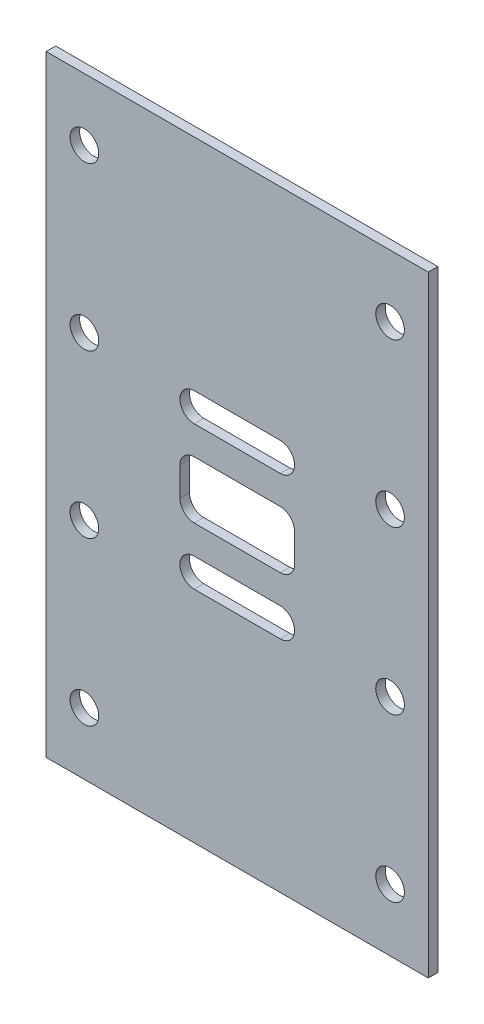
ISO-10303-21;
HEADER;
FILE_DESCRIPTION(('STEP AP214'),'2;1');
FILE_NAME('part.step','',(''),(''),'','','');
FILE_SCHEMA(('AUTOMOTIVE_DESIGN { 1 0 10303 214 1 1 1 1 }'));
ENDSEC;
DATA;
#1=APPLICATION_CONTEXT('core data for automotive mechanical design processes');
#2=APPLICATION_PROTOCOL_DEFINITION('international standard','automotive_design',2000,#1);
#3=PRODUCT_CONTEXT('',#1,'mechanical');
#4=PRODUCT('Part','Part','',(#3));
#5=PRODUCT_RELATED_PRODUCT_CATEGORY('part','',(#4));
#6=PRODUCT_DEFINITION_FORMATION('','',#4);
#7=PRODUCT_DEFINITION_CONTEXT('part definition',#1,'design');
#8=PRODUCT_DEFINITION('design','',#6,#7);
#9=PRODUCT_DEFINITION_SHAPE('','',#8);
#10=(LENGTH_UNIT() NAMED_UNIT(*) SI_UNIT(.MILLI.,.METRE.));
#11=(NAMED_UNIT(*) PLANE_ANGLE_UNIT() SI_UNIT($,.RADIAN.));
#12=(NAMED_UNIT(*) SI_UNIT($,.STERADIAN.) SOLID_ANGLE_UNIT());
#13=UNCERTAINTY_MEASURE_WITH_UNIT(LENGTH_MEASURE(1.E-05),#10,'distance_accuracy_value','');
#14=(GEOMETRIC_REPRESENTATION_CONTEXT(3) GLOBAL_UNCERTAINTY_ASSIGNED_CONTEXT((#13)) GLOBAL_UNIT_ASSIGNED_CONTEXT((#10,
#11,#12)) REPRESENTATION_CONTEXT('',''));
#15=CARTESIAN_POINT('',(0.,0.,0.));
#16=DIRECTION('',(0.,0.,1.));
#17=DIRECTION('',(1.,0.,0.));
#18=AXIS2_PLACEMENT_3D('',#15,#16,#17);
#19=CARTESIAN_POINT('',(0.,0.,1.));
#20=DIRECTION('',(0.,0.,-1.));
#21=DIRECTION('',(-1.,0.,0.));
#22=AXIS2_PLACEMENT_3D('',#19,#20,#21);
#23=PLANE('',#22);
#24=CARTESIAN_POINT('',(16.2605633802817,-9.76760563380282,1.));
#25=DIRECTION('',(0.,0.,1.));
#26=DIRECTION('',(1.,0.,0.));
#27=AXIS2_PLACEMENT_3D('',#24,#25,#26);
#28=CIRCLE('',#27,1.5);
#29=CARTESIAN_POINT('',(17.7605633802817,-9.76760563380282,1.));
#30=VERTEX_POINT('',#29);
#31=CARTESIAN_POINT('',(16.2605633802817,-11.2676056338028,1.));
#32=VERTEX_POINT('',#31);
#33=EDGE_CURVE('E404',#30,#32,#28,.F.);
#34=ORIENTED_EDGE('',*,*,#33,.T.);
#35=DIRECTION('',(-1.,0.,0.));
#36=VECTOR('',#35,1.);
#37=CARTESIAN_POINT('',(0.,-11.2676056338028,1.));
#38=LINE('',#37,#36);
#39=CARTESIAN_POINT('',(7.26056338028169,-11.2676056338028,1.));
#40=VERTEX_POINT('',#39);
#41=EDGE_CURVE('E400',#32,#40,#38,.T.);
#42=ORIENTED_EDGE('',*,*,#41,.T.);
#43=CARTESIAN_POINT('',(7.26056338028169,-9.76760563380282,1.));
#44=DIRECTION('',(0.,0.,1.));
#45=DIRECTION('',(1.,0.,0.));
#46=AXIS2_PLACEMENT_3D('',#43,#44,#45);
#47=CIRCLE('',#46,1.5);
#48=CARTESIAN_POINT('',(5.76056338028169,-9.76760563380282,1.));
#49=VERTEX_POINT('',#48);
#50=EDGE_CURVE('E395',#40,#49,#47,.F.);
#51=ORIENTED_EDGE('',*,*,#50,.T.);
#52=DIRECTION('',(0.,1.,0.));
#53=VECTOR('',#52,1.);
#54=CARTESIAN_POINT('',(5.76056338028169,0.,1.));
#55=LINE('',#54,#53);
#56=CARTESIAN_POINT('',(5.76056338028169,-6.76760563380282,1.));
#57=VERTEX_POINT('',#56);
#58=EDGE_CURVE('E420',#57,#49,#55,.F.);
#59=ORIENTED_EDGE('',*,*,#58,.F.);
#60=CARTESIAN_POINT('',(7.26056338028169,-6.76760563380282,1.));
#61=DIRECTION('',(0.,0.,1.));
#62=DIRECTION('',(1.,0.,0.));
#63=AXIS2_PLACEMENT_3D('',#60,#61,#62);
#64=CIRCLE('',#63,1.5);
#65=CARTESIAN_POINT('',(7.26056338028169,-5.26760563380282,1.));
#66=VERTEX_POINT('',#65);
#67=EDGE_CURVE('E416',#57,#66,#64,.F.);
#68=ORIENTED_EDGE('',*,*,#67,.T.);
#69=DIRECTION('',(-1.,0.,0.));
#70=VECTOR('',#69,1.);
#71=CARTESIAN_POINT('',(0.,-5.26760563380282,1.));
#72=LINE('',#71,#70);
#73=CARTESIAN_POINT('',(16.2605633802817,-5.26760563380282,1.));
#74=VERTEX_POINT('',#73);
#75=EDGE_CURVE('E412',#66,#74,#72,.F.);
#76=ORIENTED_EDGE('',*,*,#75,.T.);
#77=CARTESIAN_POINT('',(16.2605633802817,-6.76760563380282,1.));
#78=DIRECTION('',(0.,0.,1.));
#79=DIRECTION('',(1.,0.,0.));
#80=AXIS2_PLACEMENT_3D('',#77,#78,#79);
#81=CIRCLE('',#80,1.5);
#82=CARTESIAN_POINT('',(17.7605633802817,-6.76760563380283,1.));
#83=VERTEX_POINT('',#82);
#84=EDGE_CURVE('E391',#74,#83,#81,.F.);
#85=ORIENTED_EDGE('',*,*,#84,.T.);
#86=DIRECTION('',(0.,-1.,0.));
#87=VECTOR('',#86,1.);
#88=CARTESIAN_POINT('',(17.7605633802817,0.,1.));
#89=LINE('',#88,#87);
#90=EDGE_CURVE('E408',#30,#83,#89,.F.);
#91=ORIENTED_EDGE('',*,*,#90,.F.);
#92=EDGE_LOOP('',(#34,#42,#51,#59,#68,#76,#85,#91));
#93=FACE_BOUND('',#92,.T.);
#94=CARTESIAN_POINT('',(27.7605633802817,-33.7676056338028,1.));
#95=DIRECTION('',(0.,0.,-1.));
#96=DIRECTION('',(-1.,0.,0.));
#97=AXIS2_PLACEMENT_3D('',#94,#95,#96);
#98=CIRCLE('',#97,1.5);
#99=CARTESIAN_POINT('',(26.2605633802817,-33.7676056338028,1.));
#100=VERTEX_POINT('',#99);
#101=EDGE_CURVE('E285',#100,#100,#98,.T.);
#102=ORIENTED_EDGE('',*,*,#101,.T.);
#103=EDGE_LOOP('',(#102));
#104=FACE_BOUND('',#103,.T.);
#105=CARTESIAN_POINT('',(-4.23943661971831,-16.7676056338028,1.));
#106=DIRECTION('',(0.,0.,-1.));
#107=DIRECTION('',(-1.,0.,0.));
#108=AXIS2_PLACEMENT_3D('',#105,#106,#107);
#109=CIRCLE('',#108,1.5);
#110=CARTESIAN_POINT('',(-5.73943661971831,-16.7676056338028,1.));
#111=VERTEX_POINT('',#110);
#112=EDGE_CURVE('E348',#111,#111,#109,.T.);
#113=ORIENTED_EDGE('',*,*,#112,.T.);
#114=EDGE_LOOP('',(#113));
#115=FACE_BOUND('',#114,.T.);
#116=CARTESIAN_POINT('',(-4.23943661971831,-33.7676056338028,1.));
#117=DIRECTION('',(0.,0.,-1.));
#118=DIRECTION('',(-1.,0.,0.));
#119=AXIS2_PLACEMENT_3D('',#116,#117,#118);
#120=CIRCLE('',#119,1.5);
#121=CARTESIAN_POINT('',(-5.73943661971831,-33.7676056338028,1.));
#122=VERTEX_POINT('',#121);
#123=EDGE_CURVE('E344',#122,#122,#120,.T.);
#124=ORIENTED_EDGE('',*,*,#123,.T.);
#125=EDGE_LOOP('',(#124));
#126=FACE_BOUND('',#125,.T.);
#127=CARTESIAN_POINT('',(27.7605633802817,-16.7676056338028,1.));
#128=DIRECTION('',(0.,0.,-1.));
#129=DIRECTION('',(-1.,0.,0.));
#130=AXIS2_PLACEMENT_3D('',#127,#128,#129);
#131=CIRCLE('',#130,1.5);
#132=CARTESIAN_POINT('',(26.2605633802817,-16.7676056338028,1.));
#133=VERTEX_POINT('',#132);
#134=EDGE_CURVE('E340',#133,#133,#131,.T.);
#135=ORIENTED_EDGE('',*,*,#134,.T.);
#136=EDGE_LOOP('',(#135));
#137=FACE_BOUND('',#136,.T.);
#138=CARTESIAN_POINT('',(27.7605633802817,0.232394366197181,1.));
#139=DIRECTION('',(0.,0.,-1.));
#140=DIRECTION('',(-1.,0.,0.));
#141=AXIS2_PLACEMENT_3D('',#138,#139,#140);
#142=CIRCLE('',#141,1.5);
#143=CARTESIAN_POINT('',(26.2605633802817,0.232394366197181,1.));
#144=VERTEX_POINT('',#143);
#145=EDGE_CURVE('E336',#144,#144,#142,.T.);
#146=ORIENTED_EDGE('',*,*,#145,.T.);
#147=EDGE_LOOP('',(#146));
#148=FACE_BOUND('',#147,.T.);
#149=CARTESIAN_POINT('',(-4.23943661971831,0.232394366197181,1.));
#150=DIRECTION('',(0.,0.,-1.));
#151=DIRECTION('',(-1.,0.,0.));
#152=AXIS2_PLACEMENT_3D('',#149,#150,#151);
#153=CIRCLE('',#152,1.5);
#154=CARTESIAN_POINT('',(-5.73943661971831,0.232394366197181,1.));
#155=VERTEX_POINT('',#154);
#156=EDGE_CURVE('E332',#155,#155,#153,.T.);
#157=ORIENTED_EDGE('',*,*,#156,.T.);
#158=EDGE_LOOP('',(#157));
#159=FACE_BOUND('',#158,.T.);
#160=CARTESIAN_POINT('',(27.7605633802817,17.2323943661972,1.));
#161=DIRECTION('',(0.,0.,-1.));
#162=DIRECTION('',(-1.,0.,0.));
#163=AXIS2_PLACEMENT_3D('',#160,#161,#162);
#164=CIRCLE('',#163,1.5);
#165=CARTESIAN_POINT('',(26.2605633802817,17.2323943661972,1.));
#166=VERTEX_POINT('',#165);
#167=EDGE_CURVE('E328',#166,#166,#164,.T.);
#168=ORIENTED_EDGE('',*,*,#167,.T.);
#169=EDGE_LOOP('',(#168));
#170=FACE_BOUND('',#169,.T.);
#171=CARTESIAN_POINT('',(-4.23943661971831,17.2323943661972,1.));
#172=DIRECTION('',(0.,0.,-1.));
#173=DIRECTION('',(-1.,0.,0.));
#174=AXIS2_PLACEMENT_3D('',#171,#172,#173);
#175=CIRCLE('',#174,1.5);
#176=CARTESIAN_POINT('',(-5.73943661971831,17.2323943661972,1.));
#177=VERTEX_POINT('',#176);
#178=EDGE_CURVE('E324',#177,#177,#175,.T.);
#179=ORIENTED_EDGE('',*,*,#178,.T.);
#180=EDGE_LOOP('',(#179));
#181=FACE_BOUND('',#180,.T.);
#182=DIRECTION('',(0.,-1.,0.));
#183=VECTOR('',#182,1.);
#184=CARTESIAN_POINT('',(-8.23943661971831,-40.2676056338028,1.));
#185=LINE('',#184,#183);
#186=CARTESIAN_POINT('',(-8.23943661971831,23.7323943661972,1.));
#187=VERTEX_POINT('',#186);
#188=CARTESIAN_POINT('',(-8.23943661971831,-40.2676056338028,1.));
#189=VERTEX_POINT('',#188);
#190=EDGE_CURVE('E353',#187,#189,#185,.T.);
#191=ORIENTED_EDGE('',*,*,#190,.T.);
#192=DIRECTION('',(1.,0.,0.));
#193=VECTOR('',#192,1.);
#194=CARTESIAN_POINT('',(-8.23943661971831,-40.2676056338028,1.));
#195=LINE('',#194,#193);
#196=CARTESIAN_POINT('',(31.7605633802817,-40.2676056338028,1.));
#197=VERTEX_POINT('',#196);
#198=EDGE_CURVE('E357',#189,#197,#195,.T.);
#199=ORIENTED_EDGE('',*,*,#198,.T.);
#200=DIRECTION('',(0.,1.,0.));
#201=VECTOR('',#200,1.);
#202=CARTESIAN_POINT('',(31.7605633802817,-40.2676056338028,1.));
#203=LINE('',#202,#201);
#204=CARTESIAN_POINT('',(31.7605633802817,23.7323943661972,1.));
#205=VERTEX_POINT('',#204);
#206=EDGE_CURVE('E362',#197,#205,#203,.T.);
#207=ORIENTED_EDGE('',*,*,#206,.T.);
#208=DIRECTION('',(-1.,0.,0.));
#209=VECTOR('',#208,1.);
#210=CARTESIAN_POINT('',(-8.23943661971831,23.7323943661972,1.));
#211=LINE('',#210,#209);
#212=EDGE_CURVE('E366',#205,#187,#211,.T.);
#213=ORIENTED_EDGE('',*,*,#212,.T.);
#214=EDGE_LOOP('',(#191,#199,#207,#213));
#215=FACE_BOUND('',#214,.T.);
#216=CARTESIAN_POINT('',(16.2605633802817,-0.767605633802819,1.));
#217=DIRECTION('',(0.,0.,1.));
#218=DIRECTION('',(1.,0.,0.));
#219=AXIS2_PLACEMENT_3D('',#216,#217,#218);
#220=CIRCLE('',#219,1.50000000000002);
#221=CARTESIAN_POINT('',(16.2605633802817,-2.26760563380282,1.));
#222=VERTEX_POINT('',#221);
#223=CARTESIAN_POINT('',(16.2605633802817,0.732394366197185,1.));
#224=VERTEX_POINT('',#223);
#225=EDGE_CURVE('E266',#222,#224,#220,.T.);
#226=ORIENTED_EDGE('',*,*,#225,.F.);
#227=DIRECTION('',(1.,0.,0.));
#228=VECTOR('',#227,1.);
#229=CARTESIAN_POINT('',(0.,-2.26760563380282,1.));
#230=LINE('',#229,#228);
#231=CARTESIAN_POINT('',(7.26056338028169,-2.26760563380282,1.));
#232=VERTEX_POINT('',#231);
#233=EDGE_CURVE('E254',#232,#222,#230,.T.);
#234=ORIENTED_EDGE('',*,*,#233,.F.);
#235=CARTESIAN_POINT('',(7.26056338028169,-0.76760563380282,1.));
#236=DIRECTION('',(0.,0.,1.));
#237=DIRECTION('',(1.,0.,0.));
#238=AXIS2_PLACEMENT_3D('',#235,#236,#237);
#239=CIRCLE('',#238,1.5);
#240=CARTESIAN_POINT('',(7.26056338028169,0.732394366197181,1.));
#241=VERTEX_POINT('',#240);
#242=EDGE_CURVE('E244',#241,#232,#239,.T.);
#243=ORIENTED_EDGE('',*,*,#242,.F.);
#244=DIRECTION('',(-1.,0.,0.));
#245=VECTOR('',#244,1.);
#246=CARTESIAN_POINT('',(0.,0.732394366197181,1.));
#247=LINE('',#246,#245);
#248=EDGE_CURVE('E238',#241,#224,#247,.F.);
#249=ORIENTED_EDGE('',*,*,#248,.T.);
#250=EDGE_LOOP('',(#226,#234,#243,#249));
#251=FACE_BOUND('',#250,.T.);
#252=CARTESIAN_POINT('',(16.2605633802817,-15.7676056338028,1.));
#253=DIRECTION('',(0.,0.,1.));
#254=DIRECTION('',(1.,0.,0.));
#255=AXIS2_PLACEMENT_3D('',#252,#253,#254);
#256=CIRCLE('',#255,1.5);
#257=CARTESIAN_POINT('',(16.2605633802817,-17.2676056338028,1.));
#258=VERTEX_POINT('',#257);
#259=CARTESIAN_POINT('',(16.2605633802817,-14.2676056338028,1.));
#260=VERTEX_POINT('',#259);
#261=EDGE_CURVE('E268',#258,#260,#256,.T.);
#262=ORIENTED_EDGE('',*,*,#261,.F.);
#263=DIRECTION('',(1.,0.,0.));
#264=VECTOR('',#263,1.);
#265=CARTESIAN_POINT('',(0.,-17.2676056338028,1.));
#266=LINE('',#265,#264);
#267=CARTESIAN_POINT('',(7.2605633802817,-17.2676056338028,1.));
#268=VERTEX_POINT('',#267);
#269=EDGE_CURVE('E133',#268,#258,#266,.T.);
#270=ORIENTED_EDGE('',*,*,#269,.F.);
#271=CARTESIAN_POINT('',(7.2605633802817,-15.7676056338028,1.));
#272=DIRECTION('',(0.,0.,1.));
#273=DIRECTION('',(1.,0.,0.));
#274=AXIS2_PLACEMENT_3D('',#271,#272,#273);
#275=CIRCLE('',#274,1.5);
#276=CARTESIAN_POINT('',(7.2605633802817,-14.2676056338028,1.));
#277=VERTEX_POINT('',#276);
#278=EDGE_CURVE('E176',#277,#268,#275,.T.);
#279=ORIENTED_EDGE('',*,*,#278,.F.);
#280=DIRECTION('',(-1.,0.,0.));
#281=VECTOR('',#280,1.);
#282=CARTESIAN_POINT('',(0.,-14.2676056338028,1.));
#283=LINE('',#282,#281);
#284=EDGE_CURVE('E271',#277,#260,#283,.F.);
#285=ORIENTED_EDGE('',*,*,#284,.T.);
#286=EDGE_LOOP('',(#262,#270,#279,#285));
#287=FACE_BOUND('',#286,.T.);
#288=ADVANCED_FACE('F129',(#93,#104,#115,#126,#137,#148,#159,#170,#181,#215,#251,#287),#23,.F.);
#289=CARTESIAN_POINT('',(0.,0.,0.));
#290=DIRECTION('',(0.,0.,-1.));
#291=DIRECTION('',(-1.,0.,0.));
#292=AXIS2_PLACEMENT_3D('',#289,#290,#291);
#293=PLANE('',#292);
#294=DIRECTION('',(1.,0.,0.));
#295=VECTOR('',#294,1.);
#296=CARTESIAN_POINT('',(0.,-2.26760563380282,0.));
#297=LINE('',#296,#295);
#298=CARTESIAN_POINT('',(7.26056338028169,-2.26760563380282,0.));
#299=VERTEX_POINT('',#298);
#300=CARTESIAN_POINT('',(16.2605633802817,-2.26760563380283,0.));
#301=VERTEX_POINT('',#300);
#302=EDGE_CURVE('E260',#299,#301,#297,.T.);
#303=ORIENTED_EDGE('',*,*,#302,.T.);
#304=CARTESIAN_POINT('',(16.2605633802817,-0.767605633802819,0.));
#305=DIRECTION('',(0.,0.,1.));
#306=DIRECTION('',(1.,0.,0.));
#307=AXIS2_PLACEMENT_3D('',#304,#305,#306);
#308=CIRCLE('',#307,1.50000000000002);
#309=CARTESIAN_POINT('',(16.2605633802817,0.732394366197196,0.));
#310=VERTEX_POINT('',#309);
#311=EDGE_CURVE('E454',#301,#310,#308,.T.);
#312=ORIENTED_EDGE('',*,*,#311,.T.);
#313=DIRECTION('',(1.,0.,0.));
#314=VECTOR('',#313,1.);
#315=CARTESIAN_POINT('',(0.,0.732394366197181,0.));
#316=LINE('',#315,#314);
#317=CARTESIAN_POINT('',(7.26056338028169,0.732394366197181,0.));
#318=VERTEX_POINT('',#317);
#319=EDGE_CURVE('E458',#318,#310,#316,.T.);
#320=ORIENTED_EDGE('',*,*,#319,.F.);
#321=CARTESIAN_POINT('',(7.26056338028169,-0.76760563380282,0.));
#322=DIRECTION('',(0.,0.,1.));
#323=DIRECTION('',(1.,0.,0.));
#324=AXIS2_PLACEMENT_3D('',#321,#322,#323);
#325=CIRCLE('',#324,1.5);
#326=EDGE_CURVE('E462',#318,#299,#325,.T.);
#327=ORIENTED_EDGE('',*,*,#326,.T.);
#328=EDGE_LOOP('',(#303,#312,#320,#327));
#329=FACE_BOUND('',#328,.T.);
#330=DIRECTION('',(-1.,0.,0.));
#331=VECTOR('',#330,1.);
#332=CARTESIAN_POINT('',(0.,-11.2676056338028,0.));
#333=LINE('',#332,#331);
#334=CARTESIAN_POINT('',(16.2605633802817,-11.2676056338028,0.));
#335=VERTEX_POINT('',#334);
#336=CARTESIAN_POINT('',(7.2605633802817,-11.2676056338028,0.));
#337=VERTEX_POINT('',#336);
#338=EDGE_CURVE('E493',#335,#337,#333,.T.);
#339=ORIENTED_EDGE('',*,*,#338,.F.);
#340=CARTESIAN_POINT('',(16.2605633802817,-9.76760563380282,0.));
#341=DIRECTION('',(0.,0.,1.));
#342=DIRECTION('',(1.,0.,0.));
#343=AXIS2_PLACEMENT_3D('',#340,#341,#342);
#344=CIRCLE('',#343,1.5);
#345=CARTESIAN_POINT('',(17.7605633802817,-9.76760563380282,0.));
#346=VERTEX_POINT('',#345);
#347=EDGE_CURVE('E496',#346,#335,#344,.F.);
#348=ORIENTED_EDGE('',*,*,#347,.F.);
#349=DIRECTION('',(0.,1.,0.));
#350=VECTOR('',#349,1.);
#351=CARTESIAN_POINT('',(17.7605633802817,-8.26760563380282,0.));
#352=LINE('',#351,#350);
#353=CARTESIAN_POINT('',(17.7605633802817,-6.76760563380283,0.));
#354=VERTEX_POINT('',#353);
#355=EDGE_CURVE('E479',#346,#354,#352,.T.);
#356=ORIENTED_EDGE('',*,*,#355,.T.);
#357=CARTESIAN_POINT('',(16.2605633802817,-6.76760563380282,0.));
#358=DIRECTION('',(0.,0.,-1.));
#359=DIRECTION('',(-1.,0.,0.));
#360=AXIS2_PLACEMENT_3D('',#357,#358,#359);
#361=CIRCLE('',#360,1.5);
#362=CARTESIAN_POINT('',(16.2605633802817,-5.26760563380282,0.));
#363=VERTEX_POINT('',#362);
#364=EDGE_CURVE('E475',#363,#354,#361,.T.);
#365=ORIENTED_EDGE('',*,*,#364,.F.);
#366=DIRECTION('',(1.,0.,0.));
#367=VECTOR('',#366,1.);
#368=CARTESIAN_POINT('',(11.7605633802817,-5.26760563380282,0.));
#369=LINE('',#368,#367);
#370=CARTESIAN_POINT('',(7.26056338028169,-5.26760563380282,0.));
#371=VERTEX_POINT('',#370);
#372=EDGE_CURVE('E263',#371,#363,#369,.T.);
#373=ORIENTED_EDGE('',*,*,#372,.F.);
#374=CARTESIAN_POINT('',(7.26056338028169,-6.76760563380282,0.));
#375=DIRECTION('',(0.,0.,1.));
#376=DIRECTION('',(1.,0.,0.));
#377=AXIS2_PLACEMENT_3D('',#374,#375,#376);
#378=CIRCLE('',#377,1.5);
#379=CARTESIAN_POINT('',(5.76056338028169,-6.76760563380282,0.));
#380=VERTEX_POINT('',#379);
#381=EDGE_CURVE('E499',#380,#371,#378,.F.);
#382=ORIENTED_EDGE('',*,*,#381,.F.);
#383=DIRECTION('',(0.,-1.,0.));
#384=VECTOR('',#383,1.);
#385=CARTESIAN_POINT('',(5.76056338028169,0.,0.));
#386=LINE('',#385,#384);
#387=CARTESIAN_POINT('',(5.76056338028169,-9.76760563380281,0.));
#388=VERTEX_POINT('',#387);
#389=EDGE_CURVE('E503',#380,#388,#386,.T.);
#390=ORIENTED_EDGE('',*,*,#389,.T.);
#391=CARTESIAN_POINT('',(7.26056338028169,-9.76760563380282,0.));
#392=DIRECTION('',(0.,0.,1.));
#393=DIRECTION('',(1.,0.,0.));
#394=AXIS2_PLACEMENT_3D('',#391,#392,#393);
#395=CIRCLE('',#394,1.5);
#396=EDGE_CURVE('E294',#337,#388,#395,.F.);
#397=ORIENTED_EDGE('',*,*,#396,.F.);
#398=EDGE_LOOP('',(#339,#348,#356,#365,#373,#382,#390,#397));
#399=FACE_BOUND('',#398,.T.);
#400=CARTESIAN_POINT('',(27.7605633802817,-33.7676056338028,0.));
#401=DIRECTION('',(0.,0.,1.));
#402=DIRECTION('',(1.,0.,0.));
#403=AXIS2_PLACEMENT_3D('',#400,#401,#402);
#404=CIRCLE('',#403,1.5);
#405=CARTESIAN_POINT('',(29.2605633802817,-33.7676056338028,0.));
#406=VERTEX_POINT('',#405);
#407=EDGE_CURVE('E279',#406,#406,#404,.T.);
#408=ORIENTED_EDGE('',*,*,#407,.T.);
#409=EDGE_LOOP('',(#408));
#410=FACE_BOUND('',#409,.T.);
#411=CARTESIAN_POINT('',(-4.23943661971831,-16.7676056338028,0.));
#412=DIRECTION('',(0.,0.,1.));
#413=DIRECTION('',(1.,0.,0.));
#414=AXIS2_PLACEMENT_3D('',#411,#412,#413);
#415=CIRCLE('',#414,1.5);
#416=CARTESIAN_POINT('',(-2.73943661971831,-16.7676056338028,0.));
#417=VERTEX_POINT('',#416);
#418=EDGE_CURVE('E305',#417,#417,#415,.T.);
#419=ORIENTED_EDGE('',*,*,#418,.T.);
#420=EDGE_LOOP('',(#419));
#421=FACE_BOUND('',#420,.T.);
#422=CARTESIAN_POINT('',(-4.23943661971831,-33.7676056338028,0.));
#423=DIRECTION('',(0.,0.,1.));
#424=DIRECTION('',(1.,0.,0.));
#425=AXIS2_PLACEMENT_3D('',#422,#423,#424);
#426=CIRCLE('',#425,1.5);
#427=CARTESIAN_POINT('',(-2.73943661971831,-33.7676056338028,0.));
#428=VERTEX_POINT('',#427);
#429=EDGE_CURVE('E310',#428,#428,#426,.T.);
#430=ORIENTED_EDGE('',*,*,#429,.T.);
#431=EDGE_LOOP('',(#430));
#432=FACE_BOUND('',#431,.T.);
#433=CARTESIAN_POINT('',(27.7605633802817,-16.7676056338028,0.));
#434=DIRECTION('',(0.,0.,1.));
#435=DIRECTION('',(1.,0.,0.));
#436=AXIS2_PLACEMENT_3D('',#433,#434,#435);
#437=CIRCLE('',#436,1.5);
#438=CARTESIAN_POINT('',(29.2605633802817,-16.7676056338028,0.));
#439=VERTEX_POINT('',#438);
#440=EDGE_CURVE('E314',#439,#439,#437,.T.);
#441=ORIENTED_EDGE('',*,*,#440,.T.);
#442=EDGE_LOOP('',(#441));
#443=FACE_BOUND('',#442,.T.);
#444=CARTESIAN_POINT('',(27.7605633802817,0.232394366197181,0.));
#445=DIRECTION('',(0.,0.,1.));
#446=DIRECTION('',(1.,0.,0.));
#447=AXIS2_PLACEMENT_3D('',#444,#445,#446);
#448=CIRCLE('',#447,1.5);
#449=CARTESIAN_POINT('',(29.2605633802817,0.232394366197181,0.));
#450=VERTEX_POINT('',#449);
#451=EDGE_CURVE('E301',#450,#450,#448,.T.);
#452=ORIENTED_EDGE('',*,*,#451,.T.);
#453=EDGE_LOOP('',(#452));
#454=FACE_BOUND('',#453,.T.);
#455=CARTESIAN_POINT('',(-4.23943661971831,0.232394366197181,0.));
#456=DIRECTION('',(0.,0.,1.));
#457=DIRECTION('',(1.,0.,0.));
#458=AXIS2_PLACEMENT_3D('',#455,#456,#457);
#459=CIRCLE('',#458,1.5);
#460=CARTESIAN_POINT('',(-2.73943661971831,0.232394366197181,0.));
#461=VERTEX_POINT('',#460);
#462=EDGE_CURVE('E297',#461,#461,#459,.T.);
#463=ORIENTED_EDGE('',*,*,#462,.T.);
#464=EDGE_LOOP('',(#463));
#465=FACE_BOUND('',#464,.T.);
#466=CARTESIAN_POINT('',(27.7605633802817,17.2323943661972,0.));
#467=DIRECTION('',(0.,0.,1.));
#468=DIRECTION('',(1.,0.,0.));
#469=AXIS2_PLACEMENT_3D('',#466,#467,#468);
#470=CIRCLE('',#469,1.5);
#471=CARTESIAN_POINT('',(29.2605633802817,17.2323943661972,0.));
#472=VERTEX_POINT('',#471);
#473=EDGE_CURVE('E291',#472,#472,#470,.T.);
#474=ORIENTED_EDGE('',*,*,#473,.T.);
#475=EDGE_LOOP('',(#474));
#476=FACE_BOUND('',#475,.T.);
#477=CARTESIAN_POINT('',(-4.23943661971831,17.2323943661972,0.));
#478=DIRECTION('',(0.,0.,1.));
#479=DIRECTION('',(1.,0.,0.));
#480=AXIS2_PLACEMENT_3D('',#477,#478,#479);
#481=CIRCLE('',#480,1.5);
#482=CARTESIAN_POINT('',(-2.73943661971831,17.2323943661972,0.));
#483=VERTEX_POINT('',#482);
#484=EDGE_CURVE('E309',#483,#483,#481,.T.);
#485=ORIENTED_EDGE('',*,*,#484,.T.);
#486=EDGE_LOOP('',(#485));
#487=FACE_BOUND('',#486,.T.);
#488=DIRECTION('',(0.,-1.,0.));
#489=VECTOR('',#488,1.);
#490=CARTESIAN_POINT('',(-8.23943661971831,-40.2676056338028,0.));
#491=LINE('',#490,#489);
#492=CARTESIAN_POINT('',(-8.23943661971831,23.7323943661972,0.));
#493=VERTEX_POINT('',#492);
#494=CARTESIAN_POINT('',(-8.23943661971831,-40.2676056338028,0.));
#495=VERTEX_POINT('',#494);
#496=EDGE_CURVE('E352',#493,#495,#491,.T.);
#497=ORIENTED_EDGE('',*,*,#496,.F.);
#498=DIRECTION('',(-1.,0.,0.));
#499=VECTOR('',#498,1.);
#500=CARTESIAN_POINT('',(-8.23943661971831,23.7323943661972,0.));
#501=LINE('',#500,#499);
#502=CARTESIAN_POINT('',(31.7605633802817,23.7323943661972,0.));
#503=VERTEX_POINT('',#502);
#504=EDGE_CURVE('E358',#503,#493,#501,.T.);
#505=ORIENTED_EDGE('',*,*,#504,.F.);
#506=DIRECTION('',(0.,1.,0.));
#507=VECTOR('',#506,1.);
#508=CARTESIAN_POINT('',(31.7605633802817,-40.2676056338028,0.));
#509=LINE('',#508,#507);
#510=CARTESIAN_POINT('',(31.7605633802817,-40.2676056338028,0.));
#511=VERTEX_POINT('',#510);
#512=EDGE_CURVE('E376',#511,#503,#509,.T.);
#513=ORIENTED_EDGE('',*,*,#512,.F.);
#514=DIRECTION('',(1.,0.,0.));
#515=VECTOR('',#514,1.);
#516=CARTESIAN_POINT('',(-8.23943661971831,-40.2676056338028,0.));
#517=LINE('',#516,#515);
#518=EDGE_CURVE('E185',#495,#511,#517,.T.);
#519=ORIENTED_EDGE('',*,*,#518,.F.);
#520=EDGE_LOOP('',(#497,#505,#513,#519));
#521=FACE_BOUND('',#520,.T.);
#522=DIRECTION('',(1.,0.,0.));
#523=VECTOR('',#522,1.);
#524=CARTESIAN_POINT('',(0.,-17.2676056338028,0.));
#525=LINE('',#524,#523);
#526=CARTESIAN_POINT('',(7.2605633802817,-17.2676056338028,0.));
#527=VERTEX_POINT('',#526);
#528=CARTESIAN_POINT('',(16.2605633802817,-17.2676056338028,0.));
#529=VERTEX_POINT('',#528);
#530=EDGE_CURVE('E448',#527,#529,#525,.T.);
#531=ORIENTED_EDGE('',*,*,#530,.T.);
#532=CARTESIAN_POINT('',(16.2605633802817,-15.7676056338028,0.));
#533=DIRECTION('',(0.,0.,1.));
#534=DIRECTION('',(1.,0.,0.));
#535=AXIS2_PLACEMENT_3D('',#532,#533,#534);
#536=CIRCLE('',#535,1.5);
#537=CARTESIAN_POINT('',(16.2605633802817,-14.2676056338028,0.));
#538=VERTEX_POINT('',#537);
#539=EDGE_CURVE('E444',#529,#538,#536,.T.);
#540=ORIENTED_EDGE('',*,*,#539,.T.);
#541=DIRECTION('',(1.,0.,0.));
#542=VECTOR('',#541,1.);
#543=CARTESIAN_POINT('',(0.,-14.2676056338028,0.));
#544=LINE('',#543,#542);
#545=CARTESIAN_POINT('',(7.2605633802817,-14.2676056338028,0.));
#546=VERTEX_POINT('',#545);
#547=EDGE_CURVE('E440',#546,#538,#544,.T.);
#548=ORIENTED_EDGE('',*,*,#547,.F.);
#549=CARTESIAN_POINT('',(7.2605633802817,-15.7676056338028,0.));
#550=DIRECTION('',(0.,0.,1.));
#551=DIRECTION('',(1.,0.,0.));
#552=AXIS2_PLACEMENT_3D('',#549,#550,#551);
#553=CIRCLE('',#552,1.5);
#554=EDGE_CURVE('E436',#546,#527,#553,.T.);
#555=ORIENTED_EDGE('',*,*,#554,.T.);
#556=EDGE_LOOP('',(#531,#540,#548,#555));
#557=FACE_BOUND('',#556,.T.);
#558=ADVANCED_FACE('F555',(#329,#399,#410,#421,#432,#443,#454,#465,#476,#487,#521,#557),#293,.T.);
#559=CARTESIAN_POINT('',(-8.23943661971831,-40.2676056338028,1.));
#560=DIRECTION('',(1.,0.,0.));
#561=DIRECTION('',(0.,0.,-1.));
#562=AXIS2_PLACEMENT_3D('',#559,#560,#561);
#563=PLANE('',#562);
#564=ORIENTED_EDGE('',*,*,#496,.T.);
#565=DIRECTION('',(0.,0.,-1.));
#566=VECTOR('',#565,1.);
#567=CARTESIAN_POINT('',(-8.23943661971831,-40.2676056338028,1.));
#568=LINE('',#567,#566);
#569=EDGE_CURVE('E12',#189,#495,#568,.T.);
#570=ORIENTED_EDGE('',*,*,#569,.F.);
#571=ORIENTED_EDGE('',*,*,#190,.F.);
#572=DIRECTION('',(0.,0.,-1.));
#573=VECTOR('',#572,1.);
#574=CARTESIAN_POINT('',(-8.23943661971831,23.7323943661972,1.));
#575=LINE('',#574,#573);
#576=EDGE_CURVE('E370',#187,#493,#575,.T.);
#577=ORIENTED_EDGE('',*,*,#576,.T.);
#578=EDGE_LOOP('',(#564,#570,#571,#577));
#579=FACE_BOUND('',#578,.T.);
#580=ADVANCED_FACE('F131',(#579),#563,.F.);
#581=CARTESIAN_POINT('',(-8.23943661971831,-40.2676056338028,1.));
#582=DIRECTION('',(0.,1.,0.));
#583=DIRECTION('',(0.,0.,1.));
#584=AXIS2_PLACEMENT_3D('',#581,#582,#583);
#585=PLANE('',#584);
#586=ORIENTED_EDGE('',*,*,#518,.T.);
#587=DIRECTION('',(0.,0.,-1.));
#588=VECTOR('',#587,1.);
#589=CARTESIAN_POINT('',(31.7605633802817,-40.2676056338028,1.));
#590=LINE('',#589,#588);
#591=EDGE_CURVE('E139',#197,#511,#590,.T.);
#592=ORIENTED_EDGE('',*,*,#591,.F.);
#593=ORIENTED_EDGE('',*,*,#198,.F.);
#594=ORIENTED_EDGE('',*,*,#569,.T.);
#595=EDGE_LOOP('',(#586,#592,#593,#594));
#596=FACE_BOUND('',#595,.T.);
#597=ADVANCED_FACE('F583',(#596),#585,.F.);
#598=CARTESIAN_POINT('',(31.7605633802817,-40.2676056338028,1.));
#599=DIRECTION('',(-1.,0.,0.));
#600=DIRECTION('',(0.,0.,1.));
#601=AXIS2_PLACEMENT_3D('',#598,#599,#600);
#602=PLANE('',#601);
#603=ORIENTED_EDGE('',*,*,#512,.T.);
#604=DIRECTION('',(0.,0.,-1.));
#605=VECTOR('',#604,1.);
#606=CARTESIAN_POINT('',(31.7605633802817,23.7323943661972,1.));
#607=LINE('',#606,#605);
#608=EDGE_CURVE('E384',#205,#503,#607,.T.);
#609=ORIENTED_EDGE('',*,*,#608,.F.);
#610=ORIENTED_EDGE('',*,*,#206,.F.);
#611=ORIENTED_EDGE('',*,*,#591,.T.);
#612=EDGE_LOOP('',(#603,#609,#610,#611));
#613=FACE_BOUND('',#612,.T.);
#614=ADVANCED_FACE('F586',(#613),#602,.F.);
#615=CARTESIAN_POINT('',(-8.23943661971831,23.7323943661972,1.));
#616=DIRECTION('',(0.,-1.,0.));
#617=DIRECTION('',(0.,0.,-1.));
#618=AXIS2_PLACEMENT_3D('',#615,#616,#617);
#619=PLANE('',#618);
#620=ORIENTED_EDGE('',*,*,#504,.T.);
#621=ORIENTED_EDGE('',*,*,#576,.F.);
#622=ORIENTED_EDGE('',*,*,#212,.F.);
#623=ORIENTED_EDGE('',*,*,#608,.T.);
#624=EDGE_LOOP('',(#620,#621,#622,#623));
#625=FACE_BOUND('',#624,.T.);
#626=ADVANCED_FACE('F579',(#625),#619,.F.);
#627=CARTESIAN_POINT('',(-4.23943661971831,17.2323943661972,0.));
#628=DIRECTION('',(0.,0.,1.));
#629=DIRECTION('',(1.,0.,0.));
#630=AXIS2_PLACEMENT_3D('',#627,#628,#629);
#631=CYLINDRICAL_SURFACE('',#630,1.5);
#632=ORIENTED_EDGE('',*,*,#484,.F.);
#633=EDGE_LOOP('',(#632));
#634=FACE_BOUND('',#633,.T.);
#635=ORIENTED_EDGE('',*,*,#178,.F.);
#636=EDGE_LOOP('',(#635));
#637=FACE_BOUND('',#636,.T.);
#638=ADVANCED_FACE('F634',(#634,#637),#631,.F.);
#639=CARTESIAN_POINT('',(27.7605633802817,17.2323943661972,0.));
#640=DIRECTION('',(0.,0.,1.));
#641=DIRECTION('',(1.,0.,0.));
#642=AXIS2_PLACEMENT_3D('',#639,#640,#641);
#643=CYLINDRICAL_SURFACE('',#642,1.5);
#644=ORIENTED_EDGE('',*,*,#473,.F.);
#645=EDGE_LOOP('',(#644));
#646=FACE_BOUND('',#645,.T.);
#647=ORIENTED_EDGE('',*,*,#167,.F.);
#648=EDGE_LOOP('',(#647));
#649=FACE_BOUND('',#648,.T.);
#650=ADVANCED_FACE('F672',(#646,#649),#643,.F.);
#651=CARTESIAN_POINT('',(-4.23943661971831,0.232394366197181,0.));
#652=DIRECTION('',(0.,0.,1.));
#653=DIRECTION('',(1.,0.,0.));
#654=AXIS2_PLACEMENT_3D('',#651,#652,#653);
#655=CYLINDRICAL_SURFACE('',#654,1.5);
#656=ORIENTED_EDGE('',*,*,#462,.F.);
#657=EDGE_LOOP('',(#656));
#658=FACE_BOUND('',#657,.T.);
#659=ORIENTED_EDGE('',*,*,#156,.F.);
#660=EDGE_LOOP('',(#659));
#661=FACE_BOUND('',#660,.T.);
#662=ADVANCED_FACE('F681',(#658,#661),#655,.F.);
#663=CARTESIAN_POINT('',(27.7605633802817,0.232394366197181,0.));
#664=DIRECTION('',(0.,0.,1.));
#665=DIRECTION('',(1.,0.,0.));
#666=AXIS2_PLACEMENT_3D('',#663,#664,#665);
#667=CYLINDRICAL_SURFACE('',#666,1.5);
#668=ORIENTED_EDGE('',*,*,#451,.F.);
#669=EDGE_LOOP('',(#668));
#670=FACE_BOUND('',#669,.T.);
#671=ORIENTED_EDGE('',*,*,#145,.F.);
#672=EDGE_LOOP('',(#671));
#673=FACE_BOUND('',#672,.T.);
#674=ADVANCED_FACE('F691',(#670,#673),#667,.F.);
#675=CARTESIAN_POINT('',(27.7605633802817,-16.7676056338028,0.));
#676=DIRECTION('',(0.,0.,1.));
#677=DIRECTION('',(1.,0.,0.));
#678=AXIS2_PLACEMENT_3D('',#675,#676,#677);
#679=CYLINDRICAL_SURFACE('',#678,1.5);
#680=ORIENTED_EDGE('',*,*,#440,.F.);
#681=EDGE_LOOP('',(#680));
#682=FACE_BOUND('',#681,.T.);
#683=ORIENTED_EDGE('',*,*,#134,.F.);
#684=EDGE_LOOP('',(#683));
#685=FACE_BOUND('',#684,.T.);
#686=ADVANCED_FACE('F701',(#682,#685),#679,.F.);
#687=CARTESIAN_POINT('',(-4.23943661971831,-33.7676056338028,0.));
#688=DIRECTION('',(0.,0.,1.));
#689=DIRECTION('',(1.,0.,0.));
#690=AXIS2_PLACEMENT_3D('',#687,#688,#689);
#691=CYLINDRICAL_SURFACE('',#690,1.5);
#692=ORIENTED_EDGE('',*,*,#429,.F.);
#693=EDGE_LOOP('',(#692));
#694=FACE_BOUND('',#693,.T.);
#695=ORIENTED_EDGE('',*,*,#123,.F.);
#696=EDGE_LOOP('',(#695));
#697=FACE_BOUND('',#696,.T.);
#698=ADVANCED_FACE('F710',(#694,#697),#691,.F.);
#699=CARTESIAN_POINT('',(-4.23943661971831,-16.7676056338028,0.));
#700=DIRECTION('',(0.,0.,1.));
#701=DIRECTION('',(1.,0.,0.));
#702=AXIS2_PLACEMENT_3D('',#699,#700,#701);
#703=CYLINDRICAL_SURFACE('',#702,1.5);
#704=ORIENTED_EDGE('',*,*,#418,.F.);
#705=EDGE_LOOP('',(#704));
#706=FACE_BOUND('',#705,.T.);
#707=ORIENTED_EDGE('',*,*,#112,.F.);
#708=EDGE_LOOP('',(#707));
#709=FACE_BOUND('',#708,.T.);
#710=ADVANCED_FACE('F720',(#706,#709),#703,.F.);
#711=CARTESIAN_POINT('',(27.7605633802817,-33.7676056338028,0.));
#712=DIRECTION('',(0.,0.,1.));
#713=DIRECTION('',(1.,0.,0.));
#714=AXIS2_PLACEMENT_3D('',#711,#712,#713);
#715=CYLINDRICAL_SURFACE('',#714,1.5);
#716=ORIENTED_EDGE('',*,*,#407,.F.);
#717=EDGE_LOOP('',(#716));
#718=FACE_BOUND('',#717,.T.);
#719=ORIENTED_EDGE('',*,*,#101,.F.);
#720=EDGE_LOOP('',(#719));
#721=FACE_BOUND('',#720,.T.);
#722=ADVANCED_FACE('F730',(#718,#721),#715,.F.);
#723=CARTESIAN_POINT('',(5.76056338028169,0.,0.));
#724=DIRECTION('',(-1.,0.,0.));
#725=DIRECTION('',(0.,0.,1.));
#726=AXIS2_PLACEMENT_3D('',#723,#724,#725);
#727=PLANE('',#726);
#728=DIRECTION('',(0.,0.,1.));
#729=VECTOR('',#728,1.);
#730=CARTESIAN_POINT('',(5.76056338028169,-9.76760563380281,0.));
#731=LINE('',#730,#729);
#732=EDGE_CURVE('E526',#388,#49,#731,.T.);
#733=ORIENTED_EDGE('',*,*,#732,.F.);
#734=ORIENTED_EDGE('',*,*,#389,.F.);
#735=DIRECTION('',(0.,0.,1.));
#736=VECTOR('',#735,1.);
#737=CARTESIAN_POINT('',(5.76056338028169,-6.76760563380282,0.));
#738=LINE('',#737,#736);
#739=EDGE_CURVE('E522',#380,#57,#738,.T.);
#740=ORIENTED_EDGE('',*,*,#739,.T.);
#741=ORIENTED_EDGE('',*,*,#58,.T.);
#742=EDGE_LOOP('',(#733,#734,#740,#741));
#743=FACE_BOUND('',#742,.T.);
#744=ADVANCED_FACE('F613',(#743),#727,.F.);
#745=CARTESIAN_POINT('',(7.26056338028169,-6.76760563380282,0.));
#746=DIRECTION('',(0.,0.,1.));
#747=DIRECTION('',(1.,0.,0.));
#748=AXIS2_PLACEMENT_3D('',#745,#746,#747);
#749=CYLINDRICAL_SURFACE('',#748,1.5);
#750=ORIENTED_EDGE('',*,*,#67,.F.);
#751=ORIENTED_EDGE('',*,*,#739,.F.);
#752=ORIENTED_EDGE('',*,*,#381,.T.);
#753=DIRECTION('',(0.,0.,1.));
#754=VECTOR('',#753,1.);
#755=CARTESIAN_POINT('',(7.26056338028169,-5.26760563380282,0.));
#756=LINE('',#755,#754);
#757=EDGE_CURVE('E518',#371,#66,#756,.T.);
#758=ORIENTED_EDGE('',*,*,#757,.T.);
#759=EDGE_LOOP('',(#750,#751,#752,#758));
#760=FACE_BOUND('',#759,.T.);
#761=ADVANCED_FACE('F610',(#760),#749,.F.);
#762=CARTESIAN_POINT('',(0.,-5.26760563380282,0.));
#763=DIRECTION('',(0.,1.,0.));
#764=DIRECTION('',(0.,0.,1.));
#765=AXIS2_PLACEMENT_3D('',#762,#763,#764);
#766=PLANE('',#765);
#767=ORIENTED_EDGE('',*,*,#757,.F.);
#768=ORIENTED_EDGE('',*,*,#372,.T.);
#769=DIRECTION('',(0.,0.,1.));
#770=VECTOR('',#769,1.);
#771=CARTESIAN_POINT('',(16.2605633802817,-5.26760563380282,0.));
#772=LINE('',#771,#770);
#773=EDGE_CURVE('E486',#363,#74,#772,.T.);
#774=ORIENTED_EDGE('',*,*,#773,.T.);
#775=ORIENTED_EDGE('',*,*,#75,.F.);
#776=EDGE_LOOP('',(#767,#768,#774,#775));
#777=FACE_BOUND('',#776,.T.);
#778=ADVANCED_FACE('F616',(#777),#766,.F.);
#779=CARTESIAN_POINT('',(17.7605633802817,0.,0.));
#780=DIRECTION('',(-1.,0.,0.));
#781=DIRECTION('',(0.,-1.,0.));
#782=AXIS2_PLACEMENT_3D('',#779,#780,#781);
#783=PLANE('',#782);
#784=ORIENTED_EDGE('',*,*,#90,.T.);
#785=DIRECTION('',(0.,0.,1.));
#786=VECTOR('',#785,1.);
#787=CARTESIAN_POINT('',(17.7605633802817,-6.76760563380283,0.));
#788=LINE('',#787,#786);
#789=EDGE_CURVE('E483',#354,#83,#788,.T.);
#790=ORIENTED_EDGE('',*,*,#789,.F.);
#791=ORIENTED_EDGE('',*,*,#355,.F.);
#792=DIRECTION('',(0.,0.,1.));
#793=VECTOR('',#792,1.);
#794=CARTESIAN_POINT('',(17.7605633802817,-9.76760563380282,0.));
#795=LINE('',#794,#793);
#796=EDGE_CURVE('E515',#346,#30,#795,.T.);
#797=ORIENTED_EDGE('',*,*,#796,.T.);
#798=EDGE_LOOP('',(#784,#790,#791,#797));
#799=FACE_BOUND('',#798,.T.);
#800=ADVANCED_FACE('F619',(#799),#783,.T.);
#801=CARTESIAN_POINT('',(16.2605633802817,-9.76760563380282,0.));
#802=DIRECTION('',(0.,0.,1.));
#803=DIRECTION('',(1.,0.,0.));
#804=AXIS2_PLACEMENT_3D('',#801,#802,#803);
#805=CYLINDRICAL_SURFACE('',#804,1.5);
#806=ORIENTED_EDGE('',*,*,#33,.F.);
#807=ORIENTED_EDGE('',*,*,#796,.F.);
#808=ORIENTED_EDGE('',*,*,#347,.T.);
#809=DIRECTION('',(0.,0.,1.));
#810=VECTOR('',#809,1.);
#811=CARTESIAN_POINT('',(16.2605633802817,-11.2676056338028,0.));
#812=LINE('',#811,#810);
#813=EDGE_CURVE('E511',#335,#32,#812,.T.);
#814=ORIENTED_EDGE('',*,*,#813,.T.);
#815=EDGE_LOOP('',(#806,#807,#808,#814));
#816=FACE_BOUND('',#815,.T.);
#817=ADVANCED_FACE('F549',(#816),#805,.F.);
#818=CARTESIAN_POINT('',(0.,-11.2676056338028,0.));
#819=DIRECTION('',(0.,1.,0.));
#820=DIRECTION('',(0.,0.,1.));
#821=AXIS2_PLACEMENT_3D('',#818,#819,#820);
#822=PLANE('',#821);
#823=ORIENTED_EDGE('',*,*,#41,.F.);
#824=ORIENTED_EDGE('',*,*,#813,.F.);
#825=ORIENTED_EDGE('',*,*,#338,.T.);
#826=DIRECTION('',(0.,0.,1.));
#827=VECTOR('',#826,1.);
#828=CARTESIAN_POINT('',(7.2605633802817,-11.2676056338028,0.));
#829=LINE('',#828,#827);
#830=EDGE_CURVE('E507',#337,#40,#829,.T.);
#831=ORIENTED_EDGE('',*,*,#830,.T.);
#832=EDGE_LOOP('',(#823,#824,#825,#831));
#833=FACE_BOUND('',#832,.T.);
#834=ADVANCED_FACE('F545',(#833),#822,.T.);
#835=CARTESIAN_POINT('',(7.26056338028169,-9.76760563380282,0.));
#836=DIRECTION('',(0.,0.,1.));
#837=DIRECTION('',(1.,0.,0.));
#838=AXIS2_PLACEMENT_3D('',#835,#836,#837);
#839=CYLINDRICAL_SURFACE('',#838,1.5);
#840=ORIENTED_EDGE('',*,*,#50,.F.);
#841=ORIENTED_EDGE('',*,*,#830,.F.);
#842=ORIENTED_EDGE('',*,*,#396,.T.);
#843=ORIENTED_EDGE('',*,*,#732,.T.);
#844=EDGE_LOOP('',(#840,#841,#842,#843));
#845=FACE_BOUND('',#844,.T.);
#846=ADVANCED_FACE('F532',(#845),#839,.F.);
#847=CARTESIAN_POINT('',(16.2605633802817,-6.76760563380282,0.));
#848=DIRECTION('',(0.,0.,1.));
#849=DIRECTION('',(1.,0.,0.));
#850=AXIS2_PLACEMENT_3D('',#847,#848,#849);
#851=CYLINDRICAL_SURFACE('',#850,1.5);
#852=ORIENTED_EDGE('',*,*,#84,.F.);
#853=ORIENTED_EDGE('',*,*,#773,.F.);
#854=ORIENTED_EDGE('',*,*,#364,.T.);
#855=ORIENTED_EDGE('',*,*,#789,.T.);
#856=EDGE_LOOP('',(#852,#853,#854,#855));
#857=FACE_BOUND('',#856,.T.);
#858=ADVANCED_FACE('F618',(#857),#851,.F.);
#859=CARTESIAN_POINT('',(0.,-2.26760563380282,0.));
#860=DIRECTION('',(0.,-1.,0.));
#861=DIRECTION('',(0.,0.,-1.));
#862=AXIS2_PLACEMENT_3D('',#859,#860,#861);
#863=PLANE('',#862);
#864=DIRECTION('',(0.,0.,1.));
#865=VECTOR('',#864,1.);
#866=CARTESIAN_POINT('',(16.2605633802817,-2.26760563380283,0.));
#867=LINE('',#866,#865);
#868=EDGE_CURVE('E156',#301,#222,#867,.T.);
#869=ORIENTED_EDGE('',*,*,#868,.F.);
#870=ORIENTED_EDGE('',*,*,#302,.F.);
#871=DIRECTION('',(0.,0.,1.));
#872=VECTOR('',#871,1.);
#873=CARTESIAN_POINT('',(7.26056338028169,-2.26760563380282,0.));
#874=LINE('',#873,#872);
#875=EDGE_CURVE('E248',#299,#232,#874,.T.);
#876=ORIENTED_EDGE('',*,*,#875,.T.);
#877=ORIENTED_EDGE('',*,*,#233,.T.);
#878=EDGE_LOOP('',(#869,#870,#876,#877));
#879=FACE_BOUND('',#878,.T.);
#880=ADVANCED_FACE('F257',(#879),#863,.F.);
#881=CARTESIAN_POINT('',(7.26056338028169,-0.76760563380282,0.));
#882=DIRECTION('',(0.,0.,1.));
#883=DIRECTION('',(1.,0.,0.));
#884=AXIS2_PLACEMENT_3D('',#881,#882,#883);
#885=CYLINDRICAL_SURFACE('',#884,1.5);
#886=ORIENTED_EDGE('',*,*,#875,.F.);
#887=ORIENTED_EDGE('',*,*,#326,.F.);
#888=DIRECTION('',(0.,0.,1.));
#889=VECTOR('',#888,1.);
#890=CARTESIAN_POINT('',(7.26056338028169,0.732394366197181,0.));
#891=LINE('',#890,#889);
#892=EDGE_CURVE('E250',#318,#241,#891,.T.);
#893=ORIENTED_EDGE('',*,*,#892,.T.);
#894=ORIENTED_EDGE('',*,*,#242,.T.);
#895=EDGE_LOOP('',(#886,#887,#893,#894));
#896=FACE_BOUND('',#895,.T.);
#897=ADVANCED_FACE('F246',(#896),#885,.F.);
#898=CARTESIAN_POINT('',(0.,0.732394366197181,0.));
#899=DIRECTION('',(0.,-1.,0.));
#900=DIRECTION('',(0.,0.,-1.));
#901=AXIS2_PLACEMENT_3D('',#898,#899,#900);
#902=PLANE('',#901);
#903=ORIENTED_EDGE('',*,*,#248,.F.);
#904=ORIENTED_EDGE('',*,*,#892,.F.);
#905=ORIENTED_EDGE('',*,*,#319,.T.);
#906=DIRECTION('',(0.,0.,1.));
#907=VECTOR('',#906,1.);
#908=CARTESIAN_POINT('',(16.2605633802817,0.732394366197188,0.));
#909=LINE('',#908,#907);
#910=EDGE_CURVE('E467',#310,#224,#909,.T.);
#911=ORIENTED_EDGE('',*,*,#910,.T.);
#912=EDGE_LOOP('',(#903,#904,#905,#911));
#913=FACE_BOUND('',#912,.T.);
#914=ADVANCED_FACE('F828',(#913),#902,.T.);
#915=CARTESIAN_POINT('',(16.2605633802817,-0.767605633802819,0.));
#916=DIRECTION('',(0.,0.,1.));
#917=DIRECTION('',(1.,0.,0.));
#918=AXIS2_PLACEMENT_3D('',#915,#916,#917);
#919=CYLINDRICAL_SURFACE('',#918,1.50000000000002);
#920=ORIENTED_EDGE('',*,*,#910,.F.);
#921=ORIENTED_EDGE('',*,*,#311,.F.);
#922=ORIENTED_EDGE('',*,*,#868,.T.);
#923=ORIENTED_EDGE('',*,*,#225,.T.);
#924=EDGE_LOOP('',(#920,#921,#922,#923));
#925=FACE_BOUND('',#924,.T.);
#926=ADVANCED_FACE('F837',(#925),#919,.F.);
#927=CARTESIAN_POINT('',(0.,-17.2676056338028,0.));
#928=DIRECTION('',(0.,-1.,0.));
#929=DIRECTION('',(0.,0.,-1.));
#930=AXIS2_PLACEMENT_3D('',#927,#928,#929);
#931=PLANE('',#930);
#932=DIRECTION('',(0.,0.,1.));
#933=VECTOR('',#932,1.);
#934=CARTESIAN_POINT('',(16.2605633802817,-17.2676056338028,0.));
#935=LINE('',#934,#933);
#936=EDGE_CURVE('E147',#529,#258,#935,.T.);
#937=ORIENTED_EDGE('',*,*,#936,.F.);
#938=ORIENTED_EDGE('',*,*,#530,.F.);
#939=DIRECTION('',(0.,0.,1.));
#940=VECTOR('',#939,1.);
#941=CARTESIAN_POINT('',(7.2605633802817,-17.2676056338028,0.));
#942=LINE('',#941,#940);
#943=EDGE_CURVE('E396',#527,#268,#942,.T.);
#944=ORIENTED_EDGE('',*,*,#943,.T.);
#945=ORIENTED_EDGE('',*,*,#269,.T.);
#946=EDGE_LOOP('',(#937,#938,#944,#945));
#947=FACE_BOUND('',#946,.T.);
#948=ADVANCED_FACE('F598',(#947),#931,.F.);
#949=CARTESIAN_POINT('',(7.2605633802817,-15.7676056338028,0.));
#950=DIRECTION('',(0.,0.,1.));
#951=DIRECTION('',(1.,0.,0.));
#952=AXIS2_PLACEMENT_3D('',#949,#950,#951);
#953=CYLINDRICAL_SURFACE('',#952,1.5);
#954=ORIENTED_EDGE('',*,*,#943,.F.);
#955=ORIENTED_EDGE('',*,*,#554,.F.);
#956=DIRECTION('',(0.,0.,1.));
#957=VECTOR('',#956,1.);
#958=CARTESIAN_POINT('',(7.2605633802817,-14.2676056338028,0.));
#959=LINE('',#958,#957);
#960=EDGE_CURVE('E427',#546,#277,#959,.T.);
#961=ORIENTED_EDGE('',*,*,#960,.T.);
#962=ORIENTED_EDGE('',*,*,#278,.T.);
#963=EDGE_LOOP('',(#954,#955,#961,#962));
#964=FACE_BOUND('',#963,.T.);
#965=ADVANCED_FACE('F854',(#964),#953,.F.);
#966=CARTESIAN_POINT('',(0.,-14.2676056338028,0.));
#967=DIRECTION('',(0.,-1.,0.));
#968=DIRECTION('',(0.,0.,-1.));
#969=AXIS2_PLACEMENT_3D('',#966,#967,#968);
#970=PLANE('',#969);
#971=ORIENTED_EDGE('',*,*,#284,.F.);
#972=ORIENTED_EDGE('',*,*,#960,.F.);
#973=ORIENTED_EDGE('',*,*,#547,.T.);
#974=DIRECTION('',(0.,0.,1.));
#975=VECTOR('',#974,1.);
#976=CARTESIAN_POINT('',(16.2605633802817,-14.2676056338028,0.));
#977=LINE('',#976,#975);
#978=EDGE_CURVE('E430',#538,#260,#977,.T.);
#979=ORIENTED_EDGE('',*,*,#978,.T.);
#980=EDGE_LOOP('',(#971,#972,#973,#979));
#981=FACE_BOUND('',#980,.T.);
#982=ADVANCED_FACE('F863',(#981),#970,.T.);
#983=CARTESIAN_POINT('',(16.2605633802817,-15.7676056338028,0.));
#984=DIRECTION('',(0.,0.,1.));
#985=DIRECTION('',(1.,0.,0.));
#986=AXIS2_PLACEMENT_3D('',#983,#984,#985);
#987=CYLINDRICAL_SURFACE('',#986,1.5);
#988=ORIENTED_EDGE('',*,*,#978,.F.);
#989=ORIENTED_EDGE('',*,*,#539,.F.);
#990=ORIENTED_EDGE('',*,*,#936,.T.);
#991=ORIENTED_EDGE('',*,*,#261,.T.);
#992=EDGE_LOOP('',(#988,#989,#990,#991));
#993=FACE_BOUND('',#992,.T.);
#994=ADVANCED_FACE('F872',(#993),#987,.F.);
#995=CLOSED_SHELL('',(#288,#558,#580,#597,#614,#626,#638,#650,#662,#674,#686,#698,#710,#722,
#744,#761,#778,#800,#817,#834,#846,#858,#880,#897,#914,#926,#948,#965,#982,#994));
#996=MANIFOLD_SOLID_BREP('B2',#995);
#997=ADVANCED_BREP_SHAPE_REPRESENTATION('',(#18,#996),#14);
#998=SHAPE_DEFINITION_REPRESENTATION(#9,#997);
ENDSEC;
END-ISO-10303-21;
